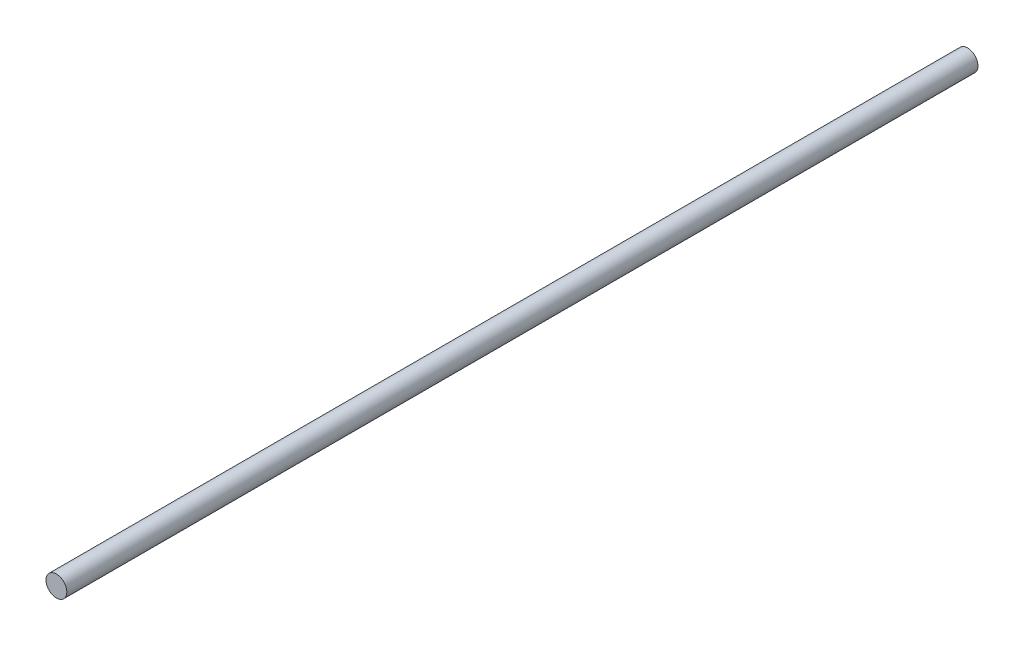
ISO-10303-21;
HEADER;
FILE_DESCRIPTION(('STEP AP214'),'2;1');
FILE_NAME('part.step','',(''),(''),'','','');
FILE_SCHEMA(('AUTOMOTIVE_DESIGN { 1 0 10303 214 1 1 1 1 }'));
ENDSEC;
DATA;
#1=APPLICATION_CONTEXT('core data for automotive mechanical design processes');
#2=APPLICATION_PROTOCOL_DEFINITION('international standard','automotive_design',2000,#1);
#3=PRODUCT_CONTEXT('',#1,'mechanical');
#4=PRODUCT('Part','Part','',(#3));
#5=PRODUCT_RELATED_PRODUCT_CATEGORY('part','',(#4));
#6=PRODUCT_DEFINITION_FORMATION('','',#4);
#7=PRODUCT_DEFINITION_CONTEXT('part definition',#1,'design');
#8=PRODUCT_DEFINITION('design','',#6,#7);
#9=PRODUCT_DEFINITION_SHAPE('','',#8);
#10=(LENGTH_UNIT() NAMED_UNIT(*) SI_UNIT(.MILLI.,.METRE.));
#11=(NAMED_UNIT(*) PLANE_ANGLE_UNIT() SI_UNIT($,.RADIAN.));
#12=(NAMED_UNIT(*) SI_UNIT($,.STERADIAN.) SOLID_ANGLE_UNIT());
#13=UNCERTAINTY_MEASURE_WITH_UNIT(LENGTH_MEASURE(1.E-05),#10,'distance_accuracy_value','');
#14=(GEOMETRIC_REPRESENTATION_CONTEXT(3) GLOBAL_UNCERTAINTY_ASSIGNED_CONTEXT((#13)) GLOBAL_UNIT_ASSIGNED_CONTEXT((#10,
#11,#12)) REPRESENTATION_CONTEXT('',''));
#15=CARTESIAN_POINT('',(0.,0.,0.));
#16=DIRECTION('',(0.,0.,1.));
#17=DIRECTION('',(1.,0.,0.));
#18=AXIS2_PLACEMENT_3D('',#15,#16,#17);
#19=CARTESIAN_POINT('',(0.,0.,350.));
#20=DIRECTION('',(0.,0.,-1.));
#21=DIRECTION('',(-1.,0.,0.));
#22=AXIS2_PLACEMENT_3D('',#19,#20,#21);
#23=CYLINDRICAL_SURFACE('',#22,4.);
#24=CARTESIAN_POINT('',(0.,0.,350.));
#25=DIRECTION('',(0.,0.,1.));
#26=DIRECTION('',(1.,0.,0.));
#27=AXIS2_PLACEMENT_3D('',#24,#25,#26);
#28=CIRCLE('',#27,4.);
#29=CARTESIAN_POINT('',(4.,0.,350.));
#30=VERTEX_POINT('',#29);
#31=EDGE_CURVE('E10',#30,#30,#28,.T.);
#32=ORIENTED_EDGE('',*,*,#31,.F.);
#33=EDGE_LOOP('',(#32));
#34=FACE_BOUND('',#33,.T.);
#35=CARTESIAN_POINT('',(0.,0.,0.));
#36=DIRECTION('',(0.,0.,1.));
#37=DIRECTION('',(1.,0.,0.));
#38=AXIS2_PLACEMENT_3D('',#35,#36,#37);
#39=CIRCLE('',#38,4.);
#40=CARTESIAN_POINT('',(4.,0.,0.));
#41=VERTEX_POINT('',#40);
#42=EDGE_CURVE('E40',#41,#41,#39,.T.);
#43=ORIENTED_EDGE('',*,*,#42,.T.);
#44=EDGE_LOOP('',(#43));
#45=FACE_BOUND('',#44,.T.);
#46=ADVANCED_FACE('F37',(#34,#45),#23,.T.);
#47=CARTESIAN_POINT('',(0.,0.,350.));
#48=DIRECTION('',(0.,0.,1.));
#49=DIRECTION('',(1.,0.,0.));
#50=AXIS2_PLACEMENT_3D('',#47,#48,#49);
#51=PLANE('',#50);
#52=ORIENTED_EDGE('',*,*,#31,.T.);
#53=EDGE_LOOP('',(#52));
#54=FACE_BOUND('',#53,.T.);
#55=ADVANCED_FACE('F54',(#54),#51,.T.);
#56=CARTESIAN_POINT('',(0.,0.,0.));
#57=DIRECTION('',(0.,0.,1.));
#58=DIRECTION('',(1.,0.,0.));
#59=AXIS2_PLACEMENT_3D('',#56,#57,#58);
#60=PLANE('',#59);
#61=ORIENTED_EDGE('',*,*,#42,.F.);
#62=EDGE_LOOP('',(#61));
#63=FACE_BOUND('',#62,.T.);
#64=ADVANCED_FACE('F52',(#63),#60,.F.);
#65=CLOSED_SHELL('',(#46,#55,#64));
#66=MANIFOLD_SOLID_BREP('B2',#65);
#67=ADVANCED_BREP_SHAPE_REPRESENTATION('',(#18,#66),#14);
#68=SHAPE_DEFINITION_REPRESENTATION(#9,#67);
ENDSEC;
END-ISO-10303-21;
